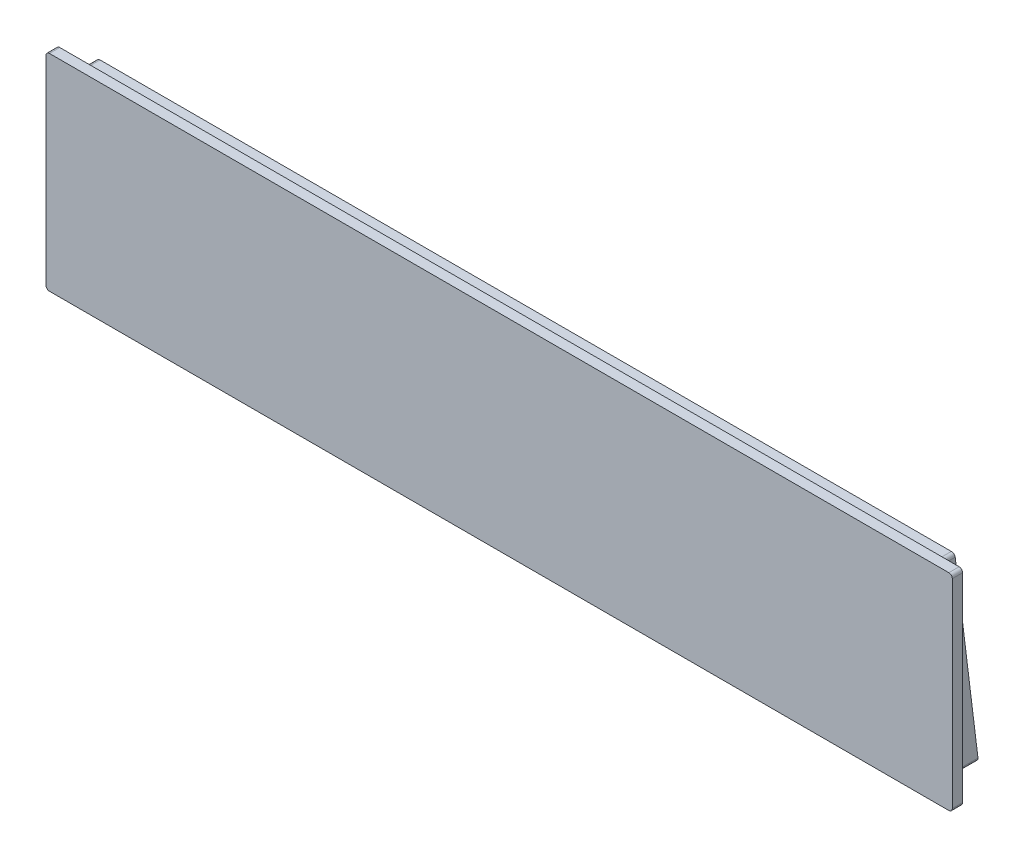
ISO-10303-21;
HEADER;
FILE_DESCRIPTION(('STEP AP214'),'2;1');
FILE_NAME('part.step','',(''),(''),'','','');
FILE_SCHEMA(('AUTOMOTIVE_DESIGN { 1 0 10303 214 1 1 1 1 }'));
ENDSEC;
DATA;
#1=APPLICATION_CONTEXT('core data for automotive mechanical design processes');
#2=APPLICATION_PROTOCOL_DEFINITION('international standard','automotive_design',2000,#1);
#3=PRODUCT_CONTEXT('',#1,'mechanical');
#4=PRODUCT('Part','Part','',(#3));
#5=PRODUCT_RELATED_PRODUCT_CATEGORY('part','',(#4));
#6=PRODUCT_DEFINITION_FORMATION('','',#4);
#7=PRODUCT_DEFINITION_CONTEXT('part definition',#1,'design');
#8=PRODUCT_DEFINITION('design','',#6,#7);
#9=PRODUCT_DEFINITION_SHAPE('','',#8);
#10=(LENGTH_UNIT() NAMED_UNIT(*) SI_UNIT(.MILLI.,.METRE.));
#11=(NAMED_UNIT(*) PLANE_ANGLE_UNIT() SI_UNIT($,.RADIAN.));
#12=(NAMED_UNIT(*) SI_UNIT($,.STERADIAN.) SOLID_ANGLE_UNIT());
#13=UNCERTAINTY_MEASURE_WITH_UNIT(LENGTH_MEASURE(1.E-05),#10,'distance_accuracy_value','');
#14=(GEOMETRIC_REPRESENTATION_CONTEXT(3) GLOBAL_UNCERTAINTY_ASSIGNED_CONTEXT((#13)) GLOBAL_UNIT_ASSIGNED_CONTEXT((#10,
#11,#12)) REPRESENTATION_CONTEXT('',''));
#15=CARTESIAN_POINT('',(0.,0.,0.));
#16=DIRECTION('',(0.,0.,1.));
#17=DIRECTION('',(1.,0.,0.));
#18=AXIS2_PLACEMENT_3D('',#15,#16,#17);
#19=CARTESIAN_POINT('',(0.,0.,0.));
#20=DIRECTION('',(0.,0.,1.));
#21=DIRECTION('',(1.,0.,0.));
#22=AXIS2_PLACEMENT_3D('',#19,#20,#21);
#23=PLANE('',#22);
#24=DIRECTION('',(1.,0.,0.));
#25=VECTOR('',#24,1.);
#26=CARTESIAN_POINT('',(132.,-30.,0.));
#27=LINE('',#26,#25);
#28=CARTESIAN_POINT('',(-131.,-30.,0.));
#29=VERTEX_POINT('',#28);
#30=CARTESIAN_POINT('',(131.,-30.,0.));
#31=VERTEX_POINT('',#30);
#32=EDGE_CURVE('E229',#29,#31,#27,.T.);
#33=ORIENTED_EDGE('',*,*,#32,.F.);
#34=CARTESIAN_POINT('',(-131.,-29.,0.));
#35=DIRECTION('',(0.,0.,1.));
#36=DIRECTION('',(1.,0.,0.));
#37=AXIS2_PLACEMENT_3D('',#34,#35,#36);
#38=CIRCLE('',#37,1.);
#39=CARTESIAN_POINT('',(-132.,-29.,0.));
#40=VERTEX_POINT('',#39);
#41=EDGE_CURVE('E287',#29,#40,#38,.F.);
#42=ORIENTED_EDGE('',*,*,#41,.T.);
#43=DIRECTION('',(0.,-1.,0.));
#44=VECTOR('',#43,1.);
#45=CARTESIAN_POINT('',(-132.,-30.,0.));
#46=LINE('',#45,#44);
#47=CARTESIAN_POINT('',(-132.,29.,0.));
#48=VERTEX_POINT('',#47);
#49=EDGE_CURVE('E200',#48,#40,#46,.T.);
#50=ORIENTED_EDGE('',*,*,#49,.F.);
#51=CARTESIAN_POINT('',(-131.,29.,0.));
#52=DIRECTION('',(0.,0.,1.));
#53=DIRECTION('',(1.,0.,0.));
#54=AXIS2_PLACEMENT_3D('',#51,#52,#53);
#55=CIRCLE('',#54,1.);
#56=CARTESIAN_POINT('',(-131.,30.,0.));
#57=VERTEX_POINT('',#56);
#58=EDGE_CURVE('E281',#48,#57,#55,.F.);
#59=ORIENTED_EDGE('',*,*,#58,.T.);
#60=DIRECTION('',(-1.,0.,0.));
#61=VECTOR('',#60,1.);
#62=CARTESIAN_POINT('',(132.,30.,0.));
#63=LINE('',#62,#61);
#64=CARTESIAN_POINT('',(131.,30.,0.));
#65=VERTEX_POINT('',#64);
#66=EDGE_CURVE('E216',#65,#57,#63,.T.);
#67=ORIENTED_EDGE('',*,*,#66,.F.);
#68=CARTESIAN_POINT('',(131.,29.,0.));
#69=DIRECTION('',(0.,0.,1.));
#70=DIRECTION('',(1.,0.,0.));
#71=AXIS2_PLACEMENT_3D('',#68,#69,#70);
#72=CIRCLE('',#71,1.);
#73=CARTESIAN_POINT('',(132.,29.,0.));
#74=VERTEX_POINT('',#73);
#75=EDGE_CURVE('E278',#65,#74,#72,.F.);
#76=ORIENTED_EDGE('',*,*,#75,.T.);
#77=DIRECTION('',(0.,1.,0.));
#78=VECTOR('',#77,1.);
#79=CARTESIAN_POINT('',(132.,-30.,0.));
#80=LINE('',#79,#78);
#81=CARTESIAN_POINT('',(132.,-29.,0.));
#82=VERTEX_POINT('',#81);
#83=EDGE_CURVE('E233',#82,#74,#80,.T.);
#84=ORIENTED_EDGE('',*,*,#83,.F.);
#85=CARTESIAN_POINT('',(131.,-29.,0.));
#86=DIRECTION('',(0.,0.,1.));
#87=DIRECTION('',(1.,0.,0.));
#88=AXIS2_PLACEMENT_3D('',#85,#86,#87);
#89=CIRCLE('',#88,1.);
#90=EDGE_CURVE('E284',#82,#31,#89,.F.);
#91=ORIENTED_EDGE('',*,*,#90,.T.);
#92=EDGE_LOOP('',(#33,#42,#50,#59,#67,#76,#84,#91));
#93=FACE_BOUND('',#92,.T.);
#94=DIRECTION('',(-1.,0.,0.));
#95=VECTOR('',#94,1.);
#96=CARTESIAN_POINT('',(189.190014309791,-28.,0.));
#97=LINE('',#96,#95);
#98=CARTESIAN_POINT('',(124.,-28.,0.));
#99=VERTEX_POINT('',#98);
#100=CARTESIAN_POINT('',(-124.,-28.,0.));
#101=VERTEX_POINT('',#100);
#102=EDGE_CURVE('E197',#99,#101,#97,.T.);
#103=ORIENTED_EDGE('',*,*,#102,.F.);
#104=CARTESIAN_POINT('',(124.,-27.,0.));
#105=DIRECTION('',(0.,0.,1.));
#106=DIRECTION('',(1.,0.,0.));
#107=AXIS2_PLACEMENT_3D('',#104,#105,#106);
#108=CIRCLE('',#107,1.);
#109=CARTESIAN_POINT('',(125.,-27.,0.));
#110=VERTEX_POINT('',#109);
#111=EDGE_CURVE('E12',#99,#110,#108,.T.);
#112=ORIENTED_EDGE('',*,*,#111,.T.);
#113=DIRECTION('',(0.,1.,0.));
#114=VECTOR('',#113,1.);
#115=CARTESIAN_POINT('',(125.,-28.,0.));
#116=LINE('',#115,#114);
#117=CARTESIAN_POINT('',(125.,27.,0.));
#118=VERTEX_POINT('',#117);
#119=EDGE_CURVE('E196',#110,#118,#116,.T.);
#120=ORIENTED_EDGE('',*,*,#119,.T.);
#121=CARTESIAN_POINT('',(124.,27.,0.));
#122=DIRECTION('',(0.,0.,1.));
#123=DIRECTION('',(1.,0.,0.));
#124=AXIS2_PLACEMENT_3D('',#121,#122,#123);
#125=CIRCLE('',#124,1.);
#126=CARTESIAN_POINT('',(124.,28.,0.));
#127=VERTEX_POINT('',#126);
#128=EDGE_CURVE('E49',#118,#127,#125,.T.);
#129=ORIENTED_EDGE('',*,*,#128,.T.);
#130=DIRECTION('',(-1.,0.,0.));
#131=VECTOR('',#130,1.);
#132=CARTESIAN_POINT('',(189.190014309791,28.,0.));
#133=LINE('',#132,#131);
#134=CARTESIAN_POINT('',(-124.,28.,0.));
#135=VERTEX_POINT('',#134);
#136=EDGE_CURVE('E184',#127,#135,#133,.T.);
#137=ORIENTED_EDGE('',*,*,#136,.T.);
#138=CARTESIAN_POINT('',(-124.,27.,0.));
#139=DIRECTION('',(0.,0.,1.));
#140=DIRECTION('',(1.,0.,0.));
#141=AXIS2_PLACEMENT_3D('',#138,#139,#140);
#142=CIRCLE('',#141,1.);
#143=CARTESIAN_POINT('',(-125.,27.,0.));
#144=VERTEX_POINT('',#143);
#145=EDGE_CURVE('E166',#135,#144,#142,.T.);
#146=ORIENTED_EDGE('',*,*,#145,.T.);
#147=DIRECTION('',(0.,1.,0.));
#148=VECTOR('',#147,1.);
#149=CARTESIAN_POINT('',(-125.,-28.,0.));
#150=LINE('',#149,#148);
#151=CARTESIAN_POINT('',(-125.,-27.,0.));
#152=VERTEX_POINT('',#151);
#153=EDGE_CURVE('E173',#152,#144,#150,.T.);
#154=ORIENTED_EDGE('',*,*,#153,.F.);
#155=CARTESIAN_POINT('',(-124.,-27.,0.));
#156=DIRECTION('',(0.,0.,1.));
#157=DIRECTION('',(1.,0.,0.));
#158=AXIS2_PLACEMENT_3D('',#155,#156,#157);
#159=CIRCLE('',#158,1.);
#160=EDGE_CURVE('E155',#152,#101,#159,.T.);
#161=ORIENTED_EDGE('',*,*,#160,.T.);
#162=EDGE_LOOP('',(#103,#112,#120,#129,#137,#146,#154,#161));
#163=FACE_BOUND('',#162,.T.);
#164=ADVANCED_FACE('F40',(#93,#163),#23,.F.);
#165=CARTESIAN_POINT('',(-132.,-30.,3.));
#166=DIRECTION('',(1.,0.,0.));
#167=DIRECTION('',(0.,0.,-1.));
#168=AXIS2_PLACEMENT_3D('',#165,#166,#167);
#169=PLANE('',#168);
#170=ORIENTED_EDGE('',*,*,#49,.T.);
#171=DIRECTION('',(0.,0.,-1.));
#172=VECTOR('',#171,1.);
#173=CARTESIAN_POINT('',(-132.,-29.,3.));
#174=LINE('',#173,#172);
#175=CARTESIAN_POINT('',(-132.,-29.,3.));
#176=VERTEX_POINT('',#175);
#177=EDGE_CURVE('E294',#40,#176,#174,.F.);
#178=ORIENTED_EDGE('',*,*,#177,.T.);
#179=DIRECTION('',(0.,-1.,0.));
#180=VECTOR('',#179,1.);
#181=CARTESIAN_POINT('',(-132.,-30.,3.));
#182=LINE('',#181,#180);
#183=CARTESIAN_POINT('',(-132.,29.,3.));
#184=VERTEX_POINT('',#183);
#185=EDGE_CURVE('E211',#184,#176,#182,.T.);
#186=ORIENTED_EDGE('',*,*,#185,.F.);
#187=DIRECTION('',(0.,0.,-1.));
#188=VECTOR('',#187,1.);
#189=CARTESIAN_POINT('',(-132.,29.,3.));
#190=LINE('',#189,#188);
#191=EDGE_CURVE('E290',#184,#48,#190,.T.);
#192=ORIENTED_EDGE('',*,*,#191,.T.);
#193=EDGE_LOOP('',(#170,#178,#186,#192));
#194=FACE_BOUND('',#193,.T.);
#195=ADVANCED_FACE('F357',(#194),#169,.F.);
#196=CARTESIAN_POINT('',(132.,-30.,3.));
#197=DIRECTION('',(0.,1.,0.));
#198=DIRECTION('',(-1.,0.,0.));
#199=AXIS2_PLACEMENT_3D('',#196,#197,#198);
#200=PLANE('',#199);
#201=DIRECTION('',(1.,0.,0.));
#202=VECTOR('',#201,1.);
#203=CARTESIAN_POINT('',(132.,-30.,3.));
#204=LINE('',#203,#202);
#205=CARTESIAN_POINT('',(-131.,-30.,3.));
#206=VERTEX_POINT('',#205);
#207=CARTESIAN_POINT('',(131.,-30.,3.));
#208=VERTEX_POINT('',#207);
#209=EDGE_CURVE('E215',#206,#208,#204,.T.);
#210=ORIENTED_EDGE('',*,*,#209,.F.);
#211=DIRECTION('',(0.,0.,-1.));
#212=VECTOR('',#211,1.);
#213=CARTESIAN_POINT('',(-131.,-30.,3.));
#214=LINE('',#213,#212);
#215=EDGE_CURVE('E274',#206,#29,#214,.T.);
#216=ORIENTED_EDGE('',*,*,#215,.T.);
#217=ORIENTED_EDGE('',*,*,#32,.T.);
#218=DIRECTION('',(0.,0.,-1.));
#219=VECTOR('',#218,1.);
#220=CARTESIAN_POINT('',(131.,-30.,3.));
#221=LINE('',#220,#219);
#222=EDGE_CURVE('E271',#31,#208,#221,.F.);
#223=ORIENTED_EDGE('',*,*,#222,.T.);
#224=EDGE_LOOP('',(#210,#216,#217,#223));
#225=FACE_BOUND('',#224,.T.);
#226=ADVANCED_FACE('F363',(#225),#200,.F.);
#227=CARTESIAN_POINT('',(132.,-30.,3.));
#228=DIRECTION('',(-1.,0.,0.));
#229=DIRECTION('',(0.,0.,1.));
#230=AXIS2_PLACEMENT_3D('',#227,#228,#229);
#231=PLANE('',#230);
#232=DIRECTION('',(0.,1.,0.));
#233=VECTOR('',#232,1.);
#234=CARTESIAN_POINT('',(132.,-30.,3.));
#235=LINE('',#234,#233);
#236=CARTESIAN_POINT('',(132.,-29.,3.));
#237=VERTEX_POINT('',#236);
#238=CARTESIAN_POINT('',(132.,29.,3.));
#239=VERTEX_POINT('',#238);
#240=EDGE_CURVE('E220',#237,#239,#235,.T.);
#241=ORIENTED_EDGE('',*,*,#240,.F.);
#242=DIRECTION('',(0.,0.,-1.));
#243=VECTOR('',#242,1.);
#244=CARTESIAN_POINT('',(132.,-29.,3.));
#245=LINE('',#244,#243);
#246=EDGE_CURVE('E311',#237,#82,#245,.T.);
#247=ORIENTED_EDGE('',*,*,#246,.T.);
#248=ORIENTED_EDGE('',*,*,#83,.T.);
#249=DIRECTION('',(0.,0.,-1.));
#250=VECTOR('',#249,1.);
#251=CARTESIAN_POINT('',(132.,29.,3.));
#252=LINE('',#251,#250);
#253=EDGE_CURVE('E308',#74,#239,#252,.F.);
#254=ORIENTED_EDGE('',*,*,#253,.T.);
#255=EDGE_LOOP('',(#241,#247,#248,#254));
#256=FACE_BOUND('',#255,.T.);
#257=ADVANCED_FACE('F372',(#256),#231,.F.);
#258=CARTESIAN_POINT('',(132.,30.,3.));
#259=DIRECTION('',(0.,-1.,0.));
#260=DIRECTION('',(1.,0.,0.));
#261=AXIS2_PLACEMENT_3D('',#258,#259,#260);
#262=PLANE('',#261);
#263=ORIENTED_EDGE('',*,*,#66,.T.);
#264=DIRECTION('',(0.,0.,-1.));
#265=VECTOR('',#264,1.);
#266=CARTESIAN_POINT('',(-131.,30.,3.));
#267=LINE('',#266,#265);
#268=CARTESIAN_POINT('',(-131.,30.,3.));
#269=VERTEX_POINT('',#268);
#270=EDGE_CURVE('E56',#57,#269,#267,.F.);
#271=ORIENTED_EDGE('',*,*,#270,.T.);
#272=DIRECTION('',(-1.,0.,0.));
#273=VECTOR('',#272,1.);
#274=CARTESIAN_POINT('',(132.,30.,3.));
#275=LINE('',#274,#273);
#276=CARTESIAN_POINT('',(131.,30.,3.));
#277=VERTEX_POINT('',#276);
#278=EDGE_CURVE('E223',#277,#269,#275,.T.);
#279=ORIENTED_EDGE('',*,*,#278,.F.);
#280=DIRECTION('',(0.,0.,-1.));
#281=VECTOR('',#280,1.);
#282=CARTESIAN_POINT('',(131.,30.,3.));
#283=LINE('',#282,#281);
#284=EDGE_CURVE('E315',#277,#65,#283,.T.);
#285=ORIENTED_EDGE('',*,*,#284,.T.);
#286=EDGE_LOOP('',(#263,#271,#279,#285));
#287=FACE_BOUND('',#286,.T.);
#288=ADVANCED_FACE('F369',(#287),#262,.F.);
#289=CARTESIAN_POINT('',(0.,0.,3.));
#290=DIRECTION('',(0.,0.,1.));
#291=DIRECTION('',(1.,0.,0.));
#292=AXIS2_PLACEMENT_3D('',#289,#290,#291);
#293=PLANE('',#292);
#294=ORIENTED_EDGE('',*,*,#185,.T.);
#295=CARTESIAN_POINT('',(-131.,-29.,3.));
#296=DIRECTION('',(0.,0.,1.));
#297=DIRECTION('',(1.,0.,0.));
#298=AXIS2_PLACEMENT_3D('',#295,#296,#297);
#299=CIRCLE('',#298,1.);
#300=EDGE_CURVE('E305',#176,#206,#299,.T.);
#301=ORIENTED_EDGE('',*,*,#300,.T.);
#302=ORIENTED_EDGE('',*,*,#209,.T.);
#303=CARTESIAN_POINT('',(131.,-29.,3.));
#304=DIRECTION('',(0.,0.,1.));
#305=DIRECTION('',(1.,0.,0.));
#306=AXIS2_PLACEMENT_3D('',#303,#304,#305);
#307=CIRCLE('',#306,1.);
#308=EDGE_CURVE('E302',#208,#237,#307,.T.);
#309=ORIENTED_EDGE('',*,*,#308,.T.);
#310=ORIENTED_EDGE('',*,*,#240,.T.);
#311=CARTESIAN_POINT('',(131.,29.,3.));
#312=DIRECTION('',(0.,0.,1.));
#313=DIRECTION('',(1.,0.,0.));
#314=AXIS2_PLACEMENT_3D('',#311,#312,#313);
#315=CIRCLE('',#314,1.);
#316=EDGE_CURVE('E63',#239,#277,#315,.T.);
#317=ORIENTED_EDGE('',*,*,#316,.T.);
#318=ORIENTED_EDGE('',*,*,#278,.T.);
#319=CARTESIAN_POINT('',(-131.,29.,3.));
#320=DIRECTION('',(0.,0.,1.));
#321=DIRECTION('',(1.,0.,0.));
#322=AXIS2_PLACEMENT_3D('',#319,#320,#321);
#323=CIRCLE('',#322,1.);
#324=EDGE_CURVE('E299',#269,#184,#323,.T.);
#325=ORIENTED_EDGE('',*,*,#324,.T.);
#326=EDGE_LOOP('',(#294,#301,#302,#309,#310,#317,#318,#325));
#327=FACE_BOUND('',#326,.T.);
#328=ADVANCED_FACE('F368',(#327),#293,.T.);
#329=CARTESIAN_POINT('',(189.190014309791,28.,0.));
#330=DIRECTION('',(0.,-1.,0.));
#331=DIRECTION('',(0.,0.,-1.));
#332=AXIS2_PLACEMENT_3D('',#329,#330,#331);
#333=PLANE('',#332);
#334=DIRECTION('',(-1.,0.,0.));
#335=VECTOR('',#334,1.);
#336=CARTESIAN_POINT('',(189.190014309791,28.,-4.73));
#337=LINE('',#336,#335);
#338=CARTESIAN_POINT('',(124.,28.,-4.73));
#339=VERTEX_POINT('',#338);
#340=CARTESIAN_POINT('',(-124.,28.,-4.73));
#341=VERTEX_POINT('',#340);
#342=EDGE_CURVE('E188',#339,#341,#337,.T.);
#343=ORIENTED_EDGE('',*,*,#342,.T.);
#344=DIRECTION('',(0.,0.,-1.));
#345=VECTOR('',#344,1.);
#346=CARTESIAN_POINT('',(-124.,28.,0.));
#347=LINE('',#346,#345);
#348=EDGE_CURVE('E262',#341,#135,#347,.F.);
#349=ORIENTED_EDGE('',*,*,#348,.T.);
#350=ORIENTED_EDGE('',*,*,#136,.F.);
#351=DIRECTION('',(0.,0.,-1.));
#352=VECTOR('',#351,1.);
#353=CARTESIAN_POINT('',(124.,28.,0.));
#354=LINE('',#353,#352);
#355=EDGE_CURVE('E258',#127,#339,#354,.T.);
#356=ORIENTED_EDGE('',*,*,#355,.T.);
#357=EDGE_LOOP('',(#343,#349,#350,#356));
#358=FACE_BOUND('',#357,.T.);
#359=ADVANCED_FACE('F330',(#358),#333,.F.);
#360=CARTESIAN_POINT('',(189.190014309791,28.,-4.73));
#361=DIRECTION('',(0.,-0.121869343405141,0.992546151641323));
#362=DIRECTION('',(0.,-0.992546151641323,-0.121869343405141));
#363=AXIS2_PLACEMENT_3D('',#360,#361,#362);
#364=PLANE('',#363);
#365=DIRECTION('',(-1.,0.,0.));
#366=VECTOR('',#365,1.);
#367=CARTESIAN_POINT('',(189.190014309791,-28.,-11.6059354105623));
#368=LINE('',#367,#366);
#369=CARTESIAN_POINT('',(124.,-28.,-11.6059354105623));
#370=VERTEX_POINT('',#369);
#371=CARTESIAN_POINT('',(-124.,-28.,-11.6059354105623));
#372=VERTEX_POINT('',#371);
#373=EDGE_CURVE('E205',#370,#372,#368,.T.);
#374=ORIENTED_EDGE('',*,*,#373,.T.);
#375=CARTESIAN_POINT('',(-124.,-27.,-11.4831508496594));
#376=DIRECTION('',(0.,-0.121869343405141,0.992546151641323));
#377=DIRECTION('',(0.,0.992546151641323,0.121869343405141));
#378=AXIS2_PLACEMENT_3D('',#375,#376,#377);
#379=ELLIPSE('',#378,1.00750982545885,1.);
#380=CARTESIAN_POINT('',(-125.,-27.,-11.4831508496594));
#381=VERTEX_POINT('',#380);
#382=EDGE_CURVE('E255',#372,#381,#379,.F.);
#383=ORIENTED_EDGE('',*,*,#382,.T.);
#384=DIRECTION('',(0.,-0.992546151641323,-0.121869343405141));
#385=VECTOR('',#384,1.);
#386=CARTESIAN_POINT('',(-125.,28.,-4.73));
#387=LINE('',#386,#385);
#388=CARTESIAN_POINT('',(-125.,27.,-4.8527845609029));
#389=VERTEX_POINT('',#388);
#390=EDGE_CURVE('E176',#389,#381,#387,.T.);
#391=ORIENTED_EDGE('',*,*,#390,.F.);
#392=CARTESIAN_POINT('',(-124.,27.,-4.8527845609029));
#393=DIRECTION('',(0.,-0.121869343405141,0.992546151641323));
#394=DIRECTION('',(0.,-0.992546151641323,-0.121869343405141));
#395=AXIS2_PLACEMENT_3D('',#392,#393,#394);
#396=ELLIPSE('',#395,1.00750982545885,1.);
#397=EDGE_CURVE('E252',#389,#341,#396,.F.);
#398=ORIENTED_EDGE('',*,*,#397,.T.);
#399=ORIENTED_EDGE('',*,*,#342,.F.);
#400=CARTESIAN_POINT('',(124.,27.,-4.8527845609029));
#401=DIRECTION('',(0.,-0.121869343405141,0.992546151641323));
#402=DIRECTION('',(0.,-0.992546151641323,-0.121869343405141));
#403=AXIS2_PLACEMENT_3D('',#400,#401,#402);
#404=ELLIPSE('',#403,1.00750982545885,1.);
#405=CARTESIAN_POINT('',(125.,27.,-4.8527845609029));
#406=VERTEX_POINT('',#405);
#407=EDGE_CURVE('E249',#339,#406,#404,.F.);
#408=ORIENTED_EDGE('',*,*,#407,.T.);
#409=DIRECTION('',(0.,-0.992546151641323,-0.121869343405141));
#410=VECTOR('',#409,1.);
#411=CARTESIAN_POINT('',(125.,28.,-4.73));
#412=LINE('',#411,#410);
#413=CARTESIAN_POINT('',(125.,-27.,-11.4831508496594));
#414=VERTEX_POINT('',#413);
#415=EDGE_CURVE('E192',#406,#414,#412,.T.);
#416=ORIENTED_EDGE('',*,*,#415,.T.);
#417=CARTESIAN_POINT('',(124.,-27.,-11.4831508496594));
#418=DIRECTION('',(0.,-0.121869343405141,0.992546151641323));
#419=DIRECTION('',(0.,0.992546151641323,0.121869343405141));
#420=AXIS2_PLACEMENT_3D('',#417,#418,#419);
#421=ELLIPSE('',#420,1.00750982545885,1.);
#422=EDGE_CURVE('E246',#414,#370,#421,.F.);
#423=ORIENTED_EDGE('',*,*,#422,.T.);
#424=EDGE_LOOP('',(#374,#383,#391,#398,#399,#408,#416,#423));
#425=FACE_BOUND('',#424,.T.);
#426=ADVANCED_FACE('F336',(#425),#364,.F.);
#427=CARTESIAN_POINT('',(189.190014309791,-28.,-11.6059354105623));
#428=DIRECTION('',(0.,1.,0.));
#429=DIRECTION('',(0.,0.,1.));
#430=AXIS2_PLACEMENT_3D('',#427,#428,#429);
#431=PLANE('',#430);
#432=ORIENTED_EDGE('',*,*,#102,.T.);
#433=DIRECTION('',(0.,0.,1.));
#434=VECTOR('',#433,1.);
#435=CARTESIAN_POINT('',(-124.,-28.,-11.6059354105623));
#436=LINE('',#435,#434);
#437=EDGE_CURVE('E160',#101,#372,#436,.F.);
#438=ORIENTED_EDGE('',*,*,#437,.T.);
#439=ORIENTED_EDGE('',*,*,#373,.F.);
#440=DIRECTION('',(0.,0.,1.));
#441=VECTOR('',#440,1.);
#442=CARTESIAN_POINT('',(124.,-28.,-11.6059354105623));
#443=LINE('',#442,#441);
#444=EDGE_CURVE('E178',#370,#99,#443,.T.);
#445=ORIENTED_EDGE('',*,*,#444,.T.);
#446=EDGE_LOOP('',(#432,#438,#439,#445));
#447=FACE_BOUND('',#446,.T.);
#448=ADVANCED_FACE('F346',(#447),#431,.F.);
#449=CARTESIAN_POINT('',(125.,-30.,3.));
#450=DIRECTION('',(-1.,0.,0.));
#451=DIRECTION('',(0.,0.,1.));
#452=AXIS2_PLACEMENT_3D('',#449,#450,#451);
#453=PLANE('',#452);
#454=ORIENTED_EDGE('',*,*,#415,.F.);
#455=DIRECTION('',(0.,0.,-1.));
#456=VECTOR('',#455,1.);
#457=CARTESIAN_POINT('',(125.,27.,2.99999999999996));
#458=LINE('',#457,#456);
#459=EDGE_CURVE('E268',#406,#118,#458,.F.);
#460=ORIENTED_EDGE('',*,*,#459,.T.);
#461=ORIENTED_EDGE('',*,*,#119,.F.);
#462=DIRECTION('',(0.,0.,1.));
#463=VECTOR('',#462,1.);
#464=CARTESIAN_POINT('',(125.,-27.,3.));
#465=LINE('',#464,#463);
#466=EDGE_CURVE('E265',#110,#414,#465,.F.);
#467=ORIENTED_EDGE('',*,*,#466,.T.);
#468=EDGE_LOOP('',(#454,#460,#461,#467));
#469=FACE_BOUND('',#468,.T.);
#470=ADVANCED_FACE('F339',(#469),#453,.F.);
#471=CARTESIAN_POINT('',(-125.,-30.,3.));
#472=DIRECTION('',(1.,0.,0.));
#473=DIRECTION('',(0.,0.,-1.));
#474=AXIS2_PLACEMENT_3D('',#471,#472,#473);
#475=PLANE('',#474);
#476=ORIENTED_EDGE('',*,*,#390,.T.);
#477=DIRECTION('',(0.,0.,1.));
#478=VECTOR('',#477,1.);
#479=CARTESIAN_POINT('',(-125.,-27.,3.));
#480=LINE('',#479,#478);
#481=EDGE_CURVE('E159',#381,#152,#480,.T.);
#482=ORIENTED_EDGE('',*,*,#481,.T.);
#483=ORIENTED_EDGE('',*,*,#153,.T.);
#484=DIRECTION('',(0.,0.,-1.));
#485=VECTOR('',#484,1.);
#486=CARTESIAN_POINT('',(-125.,27.,2.99999999999996));
#487=LINE('',#486,#485);
#488=EDGE_CURVE('E179',#144,#389,#487,.T.);
#489=ORIENTED_EDGE('',*,*,#488,.T.);
#490=EDGE_LOOP('',(#476,#482,#483,#489));
#491=FACE_BOUND('',#490,.T.);
#492=ADVANCED_FACE('F171',(#491),#475,.F.);
#493=CARTESIAN_POINT('',(-124.,-27.,3.));
#494=DIRECTION('',(0.,0.,1.));
#495=DIRECTION('',(0.,-1.,0.));
#496=AXIS2_PLACEMENT_3D('',#493,#494,#495);
#497=CYLINDRICAL_SURFACE('',#496,1.);
#498=ORIENTED_EDGE('',*,*,#382,.F.);
#499=ORIENTED_EDGE('',*,*,#437,.F.);
#500=ORIENTED_EDGE('',*,*,#160,.F.);
#501=ORIENTED_EDGE('',*,*,#481,.F.);
#502=EDGE_LOOP('',(#498,#499,#500,#501));
#503=FACE_BOUND('',#502,.T.);
#504=ADVANCED_FACE('F158',(#503),#497,.T.);
#505=CARTESIAN_POINT('',(-124.,27.,2.99999999999996));
#506=DIRECTION('',(0.,0.,-1.));
#507=DIRECTION('',(0.,1.,0.));
#508=AXIS2_PLACEMENT_3D('',#505,#506,#507);
#509=CYLINDRICAL_SURFACE('',#508,1.);
#510=ORIENTED_EDGE('',*,*,#145,.F.);
#511=ORIENTED_EDGE('',*,*,#348,.F.);
#512=ORIENTED_EDGE('',*,*,#397,.F.);
#513=ORIENTED_EDGE('',*,*,#488,.F.);
#514=EDGE_LOOP('',(#510,#511,#512,#513));
#515=FACE_BOUND('',#514,.T.);
#516=ADVANCED_FACE('F381',(#515),#509,.T.);
#517=CARTESIAN_POINT('',(124.,27.,0.));
#518=DIRECTION('',(0.,0.,-1.));
#519=DIRECTION('',(0.,1.,0.));
#520=AXIS2_PLACEMENT_3D('',#517,#518,#519);
#521=CYLINDRICAL_SURFACE('',#520,1.);
#522=ORIENTED_EDGE('',*,*,#128,.F.);
#523=ORIENTED_EDGE('',*,*,#459,.F.);
#524=ORIENTED_EDGE('',*,*,#407,.F.);
#525=ORIENTED_EDGE('',*,*,#355,.F.);
#526=EDGE_LOOP('',(#522,#523,#524,#525));
#527=FACE_BOUND('',#526,.T.);
#528=ADVANCED_FACE('F333',(#527),#521,.T.);
#529=CARTESIAN_POINT('',(124.,-27.,-11.6059354105623));
#530=DIRECTION('',(0.,0.,1.));
#531=DIRECTION('',(0.,-1.,0.));
#532=AXIS2_PLACEMENT_3D('',#529,#530,#531);
#533=CYLINDRICAL_SURFACE('',#532,1.);
#534=ORIENTED_EDGE('',*,*,#422,.F.);
#535=ORIENTED_EDGE('',*,*,#466,.F.);
#536=ORIENTED_EDGE('',*,*,#111,.F.);
#537=ORIENTED_EDGE('',*,*,#444,.F.);
#538=EDGE_LOOP('',(#534,#535,#536,#537));
#539=FACE_BOUND('',#538,.T.);
#540=ADVANCED_FACE('F342',(#539),#533,.T.);
#541=CARTESIAN_POINT('',(-131.,-29.,3.));
#542=DIRECTION('',(0.,0.,-1.));
#543=DIRECTION('',(-1.,0.,0.));
#544=AXIS2_PLACEMENT_3D('',#541,#542,#543);
#545=CYLINDRICAL_SURFACE('',#544,1.);
#546=ORIENTED_EDGE('',*,*,#300,.F.);
#547=ORIENTED_EDGE('',*,*,#177,.F.);
#548=ORIENTED_EDGE('',*,*,#41,.F.);
#549=ORIENTED_EDGE('',*,*,#215,.F.);
#550=EDGE_LOOP('',(#546,#547,#548,#549));
#551=FACE_BOUND('',#550,.T.);
#552=ADVANCED_FACE('F389',(#551),#545,.T.);
#553=CARTESIAN_POINT('',(131.,-29.,3.));
#554=DIRECTION('',(0.,0.,-1.));
#555=DIRECTION('',(-1.,0.,0.));
#556=AXIS2_PLACEMENT_3D('',#553,#554,#555);
#557=CYLINDRICAL_SURFACE('',#556,1.);
#558=ORIENTED_EDGE('',*,*,#308,.F.);
#559=ORIENTED_EDGE('',*,*,#222,.F.);
#560=ORIENTED_EDGE('',*,*,#90,.F.);
#561=ORIENTED_EDGE('',*,*,#246,.F.);
#562=EDGE_LOOP('',(#558,#559,#560,#561));
#563=FACE_BOUND('',#562,.T.);
#564=ADVANCED_FACE('F392',(#563),#557,.T.);
#565=CARTESIAN_POINT('',(-131.,29.,3.));
#566=DIRECTION('',(0.,0.,-1.));
#567=DIRECTION('',(-1.,0.,0.));
#568=AXIS2_PLACEMENT_3D('',#565,#566,#567);
#569=CYLINDRICAL_SURFACE('',#568,1.);
#570=ORIENTED_EDGE('',*,*,#324,.F.);
#571=ORIENTED_EDGE('',*,*,#270,.F.);
#572=ORIENTED_EDGE('',*,*,#58,.F.);
#573=ORIENTED_EDGE('',*,*,#191,.F.);
#574=EDGE_LOOP('',(#570,#571,#572,#573));
#575=FACE_BOUND('',#574,.T.);
#576=ADVANCED_FACE('F395',(#575),#569,.T.);
#577=CARTESIAN_POINT('',(131.,29.,3.));
#578=DIRECTION('',(0.,0.,-1.));
#579=DIRECTION('',(-1.,0.,0.));
#580=AXIS2_PLACEMENT_3D('',#577,#578,#579);
#581=CYLINDRICAL_SURFACE('',#580,1.);
#582=ORIENTED_EDGE('',*,*,#316,.F.);
#583=ORIENTED_EDGE('',*,*,#253,.F.);
#584=ORIENTED_EDGE('',*,*,#75,.F.);
#585=ORIENTED_EDGE('',*,*,#284,.F.);
#586=EDGE_LOOP('',(#582,#583,#584,#585));
#587=FACE_BOUND('',#586,.T.);
#588=ADVANCED_FACE('F42',(#587),#581,.T.);
#589=CLOSED_SHELL('',(#164,#195,#226,#257,#288,#328,#359,#426,#448,#470,#492,#504,#516,#528,
#540,#552,#564,#576,#588));
#590=MANIFOLD_SOLID_BREP('B2',#589);
#591=ADVANCED_BREP_SHAPE_REPRESENTATION('',(#18,#590),#14);
#592=SHAPE_DEFINITION_REPRESENTATION(#9,#591);
ENDSEC;
END-ISO-10303-21;
